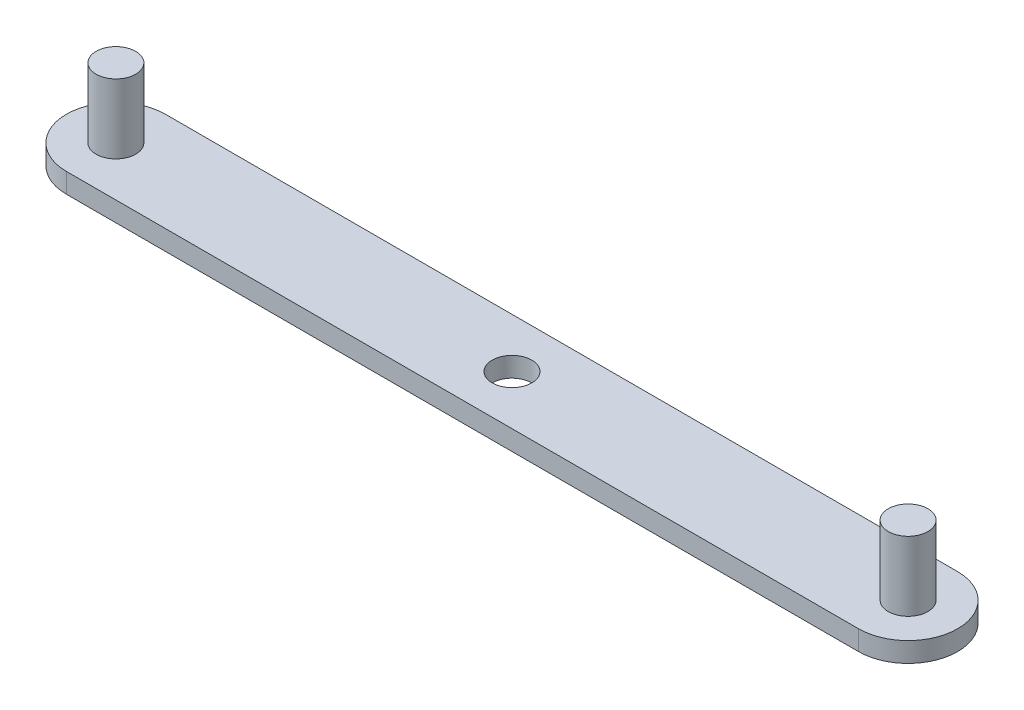
ISO-10303-21;
HEADER;
FILE_DESCRIPTION(('STEP AP214'),'2;1');
FILE_NAME('part.step','',(''),(''),'','','');
FILE_SCHEMA(('AUTOMOTIVE_DESIGN { 1 0 10303 214 1 1 1 1 }'));
ENDSEC;
DATA;
#1=APPLICATION_CONTEXT('core data for automotive mechanical design processes');
#2=APPLICATION_PROTOCOL_DEFINITION('international standard','automotive_design',2000,#1);
#3=PRODUCT_CONTEXT('',#1,'mechanical');
#4=PRODUCT('Part','Part','',(#3));
#5=PRODUCT_RELATED_PRODUCT_CATEGORY('part','',(#4));
#6=PRODUCT_DEFINITION_FORMATION('','',#4);
#7=PRODUCT_DEFINITION_CONTEXT('part definition',#1,'design');
#8=PRODUCT_DEFINITION('design','',#6,#7);
#9=PRODUCT_DEFINITION_SHAPE('','',#8);
#10=(LENGTH_UNIT() NAMED_UNIT(*) SI_UNIT(.MILLI.,.METRE.));
#11=(NAMED_UNIT(*) PLANE_ANGLE_UNIT() SI_UNIT($,.RADIAN.));
#12=(NAMED_UNIT(*) SI_UNIT($,.STERADIAN.) SOLID_ANGLE_UNIT());
#13=UNCERTAINTY_MEASURE_WITH_UNIT(LENGTH_MEASURE(1.E-05),#10,'distance_accuracy_value','');
#14=(GEOMETRIC_REPRESENTATION_CONTEXT(3) GLOBAL_UNCERTAINTY_ASSIGNED_CONTEXT((#13)) GLOBAL_UNIT_ASSIGNED_CONTEXT((#10,
#11,#12)) REPRESENTATION_CONTEXT('',''));
#15=CARTESIAN_POINT('',(0.,0.,0.));
#16=DIRECTION('',(0.,0.,1.));
#17=DIRECTION('',(1.,0.,0.));
#18=AXIS2_PLACEMENT_3D('',#15,#16,#17);
#19=CARTESIAN_POINT('',(-65.,2.,0.));
#20=DIRECTION('',(0.,1.,0.));
#21=DIRECTION('',(0.,0.,1.));
#22=AXIS2_PLACEMENT_3D('',#19,#20,#21);
#23=PLANE('',#22);
#24=CARTESIAN_POINT('',(-25.,2.,0.));
#25=DIRECTION('',(0.,1.,0.));
#26=DIRECTION('',(0.,0.,1.));
#27=AXIS2_PLACEMENT_3D('',#24,#25,#26);
#28=CIRCLE('',#27,2.);
#29=CARTESIAN_POINT('',(-25.,2.,2.));
#30=VERTEX_POINT('',#29);
#31=EDGE_CURVE('E120',#30,#30,#28,.T.);
#32=ORIENTED_EDGE('',*,*,#31,.F.);
#33=EDGE_LOOP('',(#32));
#34=FACE_BOUND('',#33,.T.);
#35=CARTESIAN_POINT('',(15.,2.,0.));
#36=DIRECTION('',(0.,1.,0.));
#37=DIRECTION('',(0.,0.,1.));
#38=AXIS2_PLACEMENT_3D('',#35,#36,#37);
#39=CIRCLE('',#38,2.);
#40=CARTESIAN_POINT('',(15.,2.,2.));
#41=VERTEX_POINT('',#40);
#42=EDGE_CURVE('E111',#41,#41,#39,.T.);
#43=ORIENTED_EDGE('',*,*,#42,.F.);
#44=EDGE_LOOP('',(#43));
#45=FACE_BOUND('',#44,.T.);
#46=CARTESIAN_POINT('',(-65.,2.,0.));
#47=DIRECTION('',(0.,1.,0.));
#48=DIRECTION('',(0.,0.,1.));
#49=AXIS2_PLACEMENT_3D('',#46,#47,#48);
#50=CIRCLE('',#49,5.);
#51=CARTESIAN_POINT('',(-65.,2.,-5.));
#52=VERTEX_POINT('',#51);
#53=CARTESIAN_POINT('',(-65.,2.,5.));
#54=VERTEX_POINT('',#53);
#55=EDGE_CURVE('E85',#52,#54,#50,.T.);
#56=ORIENTED_EDGE('',*,*,#55,.T.);
#57=DIRECTION('',(1.,0.,0.));
#58=VECTOR('',#57,1.);
#59=CARTESIAN_POINT('',(-65.,2.,5.));
#60=LINE('',#59,#58);
#61=CARTESIAN_POINT('',(15.,2.,5.));
#62=VERTEX_POINT('',#61);
#63=EDGE_CURVE('E80',#54,#62,#60,.T.);
#64=ORIENTED_EDGE('',*,*,#63,.T.);
#65=CARTESIAN_POINT('',(15.,2.,0.));
#66=DIRECTION('',(0.,1.,0.));
#67=DIRECTION('',(0.,0.,1.));
#68=AXIS2_PLACEMENT_3D('',#65,#66,#67);
#69=CIRCLE('',#68,5.);
#70=CARTESIAN_POINT('',(15.,2.,-5.));
#71=VERTEX_POINT('',#70);
#72=EDGE_CURVE('E83',#62,#71,#69,.T.);
#73=ORIENTED_EDGE('',*,*,#72,.T.);
#74=DIRECTION('',(-1.,0.,0.));
#75=VECTOR('',#74,1.);
#76=CARTESIAN_POINT('',(-65.,2.,-5.));
#77=LINE('',#76,#75);
#78=EDGE_CURVE('E50',#71,#52,#77,.T.);
#79=ORIENTED_EDGE('',*,*,#78,.T.);
#80=EDGE_LOOP('',(#56,#64,#73,#79));
#81=FACE_BOUND('',#80,.T.);
#82=CARTESIAN_POINT('',(-65.,2.,0.));
#83=DIRECTION('',(0.,1.,0.));
#84=DIRECTION('',(0.,0.,1.));
#85=AXIS2_PLACEMENT_3D('',#82,#83,#84);
#86=CIRCLE('',#85,2.);
#87=CARTESIAN_POINT('',(-65.,2.,2.));
#88=VERTEX_POINT('',#87);
#89=EDGE_CURVE('E117',#88,#88,#86,.T.);
#90=ORIENTED_EDGE('',*,*,#89,.F.);
#91=EDGE_LOOP('',(#90));
#92=FACE_BOUND('',#91,.T.);
#93=ADVANCED_FACE('F33',(#34,#45,#81,#92),#23,.T.);
#94=CARTESIAN_POINT('',(-65.,2.,0.));
#95=DIRECTION('',(0.,-1.,0.));
#96=DIRECTION('',(0.,0.,-1.));
#97=AXIS2_PLACEMENT_3D('',#94,#95,#96);
#98=CYLINDRICAL_SURFACE('',#97,5.);
#99=CARTESIAN_POINT('',(-65.,0.,0.));
#100=DIRECTION('',(0.,1.,0.));
#101=DIRECTION('',(0.,0.,1.));
#102=AXIS2_PLACEMENT_3D('',#99,#100,#101);
#103=CIRCLE('',#102,5.);
#104=CARTESIAN_POINT('',(-65.,0.,-5.));
#105=VERTEX_POINT('',#104);
#106=CARTESIAN_POINT('',(-65.,0.,5.));
#107=VERTEX_POINT('',#106);
#108=EDGE_CURVE('E97',#105,#107,#103,.T.);
#109=ORIENTED_EDGE('',*,*,#108,.T.);
#110=DIRECTION('',(0.,-1.,0.));
#111=VECTOR('',#110,1.);
#112=CARTESIAN_POINT('',(-65.,2.,5.));
#113=LINE('',#112,#111);
#114=EDGE_CURVE('E11',#54,#107,#113,.T.);
#115=ORIENTED_EDGE('',*,*,#114,.F.);
#116=ORIENTED_EDGE('',*,*,#55,.F.);
#117=DIRECTION('',(0.,-1.,0.));
#118=VECTOR('',#117,1.);
#119=CARTESIAN_POINT('',(-65.,2.,-5.));
#120=LINE('',#119,#118);
#121=EDGE_CURVE('E93',#52,#105,#120,.T.);
#122=ORIENTED_EDGE('',*,*,#121,.T.);
#123=EDGE_LOOP('',(#109,#115,#116,#122));
#124=FACE_BOUND('',#123,.T.);
#125=ADVANCED_FACE('F35',(#124),#98,.T.);
#126=CARTESIAN_POINT('',(-65.,2.,5.));
#127=DIRECTION('',(0.,0.,-1.));
#128=DIRECTION('',(-1.,0.,0.));
#129=AXIS2_PLACEMENT_3D('',#126,#127,#128);
#130=PLANE('',#129);
#131=DIRECTION('',(1.,0.,0.));
#132=VECTOR('',#131,1.);
#133=CARTESIAN_POINT('',(-65.,0.,5.));
#134=LINE('',#133,#132);
#135=CARTESIAN_POINT('',(15.,0.,5.));
#136=VERTEX_POINT('',#135);
#137=EDGE_CURVE('E89',#107,#136,#134,.T.);
#138=ORIENTED_EDGE('',*,*,#137,.T.);
#139=DIRECTION('',(0.,-1.,0.));
#140=VECTOR('',#139,1.);
#141=CARTESIAN_POINT('',(15.,2.,5.));
#142=LINE('',#141,#140);
#143=EDGE_CURVE('E42',#62,#136,#142,.T.);
#144=ORIENTED_EDGE('',*,*,#143,.F.);
#145=ORIENTED_EDGE('',*,*,#63,.F.);
#146=ORIENTED_EDGE('',*,*,#114,.T.);
#147=EDGE_LOOP('',(#138,#144,#145,#146));
#148=FACE_BOUND('',#147,.T.);
#149=ADVANCED_FACE('F88',(#148),#130,.F.);
#150=CARTESIAN_POINT('',(15.,2.,0.));
#151=DIRECTION('',(0.,-1.,0.));
#152=DIRECTION('',(0.,0.,-1.));
#153=AXIS2_PLACEMENT_3D('',#150,#151,#152);
#154=CYLINDRICAL_SURFACE('',#153,5.);
#155=CARTESIAN_POINT('',(15.,0.,0.));
#156=DIRECTION('',(0.,1.,0.));
#157=DIRECTION('',(0.,0.,1.));
#158=AXIS2_PLACEMENT_3D('',#155,#156,#157);
#159=CIRCLE('',#158,5.);
#160=CARTESIAN_POINT('',(15.,0.,-5.));
#161=VERTEX_POINT('',#160);
#162=EDGE_CURVE('E67',#136,#161,#159,.T.);
#163=ORIENTED_EDGE('',*,*,#162,.T.);
#164=DIRECTION('',(0.,-1.,0.));
#165=VECTOR('',#164,1.);
#166=CARTESIAN_POINT('',(15.,2.,-5.));
#167=LINE('',#166,#165);
#168=EDGE_CURVE('E90',#71,#161,#167,.T.);
#169=ORIENTED_EDGE('',*,*,#168,.F.);
#170=ORIENTED_EDGE('',*,*,#72,.F.);
#171=ORIENTED_EDGE('',*,*,#143,.T.);
#172=EDGE_LOOP('',(#163,#169,#170,#171));
#173=FACE_BOUND('',#172,.T.);
#174=ADVANCED_FACE('F91',(#173),#154,.T.);
#175=CARTESIAN_POINT('',(-65.,2.,-5.));
#176=DIRECTION('',(0.,0.,1.));
#177=DIRECTION('',(1.,0.,0.));
#178=AXIS2_PLACEMENT_3D('',#175,#176,#177);
#179=PLANE('',#178);
#180=DIRECTION('',(-1.,0.,0.));
#181=VECTOR('',#180,1.);
#182=CARTESIAN_POINT('',(-65.,0.,-5.));
#183=LINE('',#182,#181);
#184=EDGE_CURVE('E73',#161,#105,#183,.T.);
#185=ORIENTED_EDGE('',*,*,#184,.T.);
#186=ORIENTED_EDGE('',*,*,#121,.F.);
#187=ORIENTED_EDGE('',*,*,#78,.F.);
#188=ORIENTED_EDGE('',*,*,#168,.T.);
#189=EDGE_LOOP('',(#185,#186,#187,#188));
#190=FACE_BOUND('',#189,.T.);
#191=ADVANCED_FACE('F105',(#190),#179,.F.);
#192=CARTESIAN_POINT('',(-65.,0.,0.));
#193=DIRECTION('',(0.,1.,0.));
#194=DIRECTION('',(0.,0.,1.));
#195=AXIS2_PLACEMENT_3D('',#192,#193,#194);
#196=PLANE('',#195);
#197=CARTESIAN_POINT('',(-25.,0.,0.));
#198=DIRECTION('',(0.,-1.,0.));
#199=DIRECTION('',(0.,0.,-1.));
#200=AXIS2_PLACEMENT_3D('',#197,#198,#199);
#201=CIRCLE('',#200,2.);
#202=CARTESIAN_POINT('',(-25.,0.,-2.));
#203=VERTEX_POINT('',#202);
#204=EDGE_CURVE('E125',#203,#203,#201,.T.);
#205=ORIENTED_EDGE('',*,*,#204,.F.);
#206=EDGE_LOOP('',(#205));
#207=FACE_BOUND('',#206,.T.);
#208=ORIENTED_EDGE('',*,*,#108,.F.);
#209=ORIENTED_EDGE('',*,*,#184,.F.);
#210=ORIENTED_EDGE('',*,*,#162,.F.);
#211=ORIENTED_EDGE('',*,*,#137,.F.);
#212=EDGE_LOOP('',(#208,#209,#210,#211));
#213=FACE_BOUND('',#212,.T.);
#214=ADVANCED_FACE('F108',(#207,#213),#196,.F.);
#215=CARTESIAN_POINT('',(15.,9.,0.));
#216=DIRECTION('',(0.,-1.,0.));
#217=DIRECTION('',(0.,0.,-1.));
#218=AXIS2_PLACEMENT_3D('',#215,#216,#217);
#219=CYLINDRICAL_SURFACE('',#218,2.);
#220=CARTESIAN_POINT('',(15.,9.,0.));
#221=DIRECTION('',(0.,1.,0.));
#222=DIRECTION('',(0.,0.,1.));
#223=AXIS2_PLACEMENT_3D('',#220,#221,#222);
#224=CIRCLE('',#223,2.);
#225=CARTESIAN_POINT('',(15.,9.,2.));
#226=VERTEX_POINT('',#225);
#227=EDGE_CURVE('E100',#226,#226,#224,.T.);
#228=ORIENTED_EDGE('',*,*,#227,.F.);
#229=EDGE_LOOP('',(#228));
#230=FACE_BOUND('',#229,.T.);
#231=ORIENTED_EDGE('',*,*,#42,.T.);
#232=EDGE_LOOP('',(#231));
#233=FACE_BOUND('',#232,.T.);
#234=ADVANCED_FACE('F132',(#230,#233),#219,.T.);
#235=CARTESIAN_POINT('',(-95.5757879679987,9.,0.));
#236=DIRECTION('',(0.,1.,0.));
#237=DIRECTION('',(0.,0.,1.));
#238=AXIS2_PLACEMENT_3D('',#235,#236,#237);
#239=PLANE('',#238);
#240=ORIENTED_EDGE('',*,*,#227,.T.);
#241=EDGE_LOOP('',(#240));
#242=FACE_BOUND('',#241,.T.);
#243=ADVANCED_FACE('F138',(#242),#239,.T.);
#244=CARTESIAN_POINT('',(-65.,9.,0.));
#245=DIRECTION('',(0.,-1.,0.));
#246=DIRECTION('',(0.,0.,-1.));
#247=AXIS2_PLACEMENT_3D('',#244,#245,#246);
#248=CYLINDRICAL_SURFACE('',#247,2.);
#249=CARTESIAN_POINT('',(-65.,9.,0.));
#250=DIRECTION('',(0.,1.,0.));
#251=DIRECTION('',(0.,0.,1.));
#252=AXIS2_PLACEMENT_3D('',#249,#250,#251);
#253=CIRCLE('',#252,2.);
#254=CARTESIAN_POINT('',(-65.,9.,2.));
#255=VERTEX_POINT('',#254);
#256=EDGE_CURVE('E114',#255,#255,#253,.T.);
#257=ORIENTED_EDGE('',*,*,#256,.F.);
#258=EDGE_LOOP('',(#257));
#259=FACE_BOUND('',#258,.T.);
#260=ORIENTED_EDGE('',*,*,#89,.T.);
#261=EDGE_LOOP('',(#260));
#262=FACE_BOUND('',#261,.T.);
#263=ADVANCED_FACE('F153',(#259,#262),#248,.T.);
#264=CARTESIAN_POINT('',(-95.5757879679987,9.,0.));
#265=DIRECTION('',(0.,1.,0.));
#266=DIRECTION('',(0.,0.,1.));
#267=AXIS2_PLACEMENT_3D('',#264,#265,#266);
#268=PLANE('',#267);
#269=ORIENTED_EDGE('',*,*,#256,.T.);
#270=EDGE_LOOP('',(#269));
#271=FACE_BOUND('',#270,.T.);
#272=ADVANCED_FACE('F157',(#271),#268,.T.);
#273=CARTESIAN_POINT('',(-25.,10.,0.));
#274=DIRECTION('',(0.,-1.,0.));
#275=DIRECTION('',(0.,0.,-1.));
#276=AXIS2_PLACEMENT_3D('',#273,#274,#275);
#277=CYLINDRICAL_SURFACE('',#276,2.);
#278=ORIENTED_EDGE('',*,*,#31,.T.);
#279=EDGE_LOOP('',(#278));
#280=FACE_BOUND('',#279,.T.);
#281=ORIENTED_EDGE('',*,*,#204,.T.);
#282=EDGE_LOOP('',(#281));
#283=FACE_BOUND('',#282,.T.);
#284=ADVANCED_FACE('F129',(#280,#283),#277,.F.);
#285=CLOSED_SHELL('',(#93,#125,#149,#174,#191,#214,#234,#243,#263,#272,#284));
#286=MANIFOLD_SOLID_BREP('B2',#285);
#287=ADVANCED_BREP_SHAPE_REPRESENTATION('',(#18,#286),#14);
#288=SHAPE_DEFINITION_REPRESENTATION(#9,#287);
ENDSEC;
END-ISO-10303-21;
